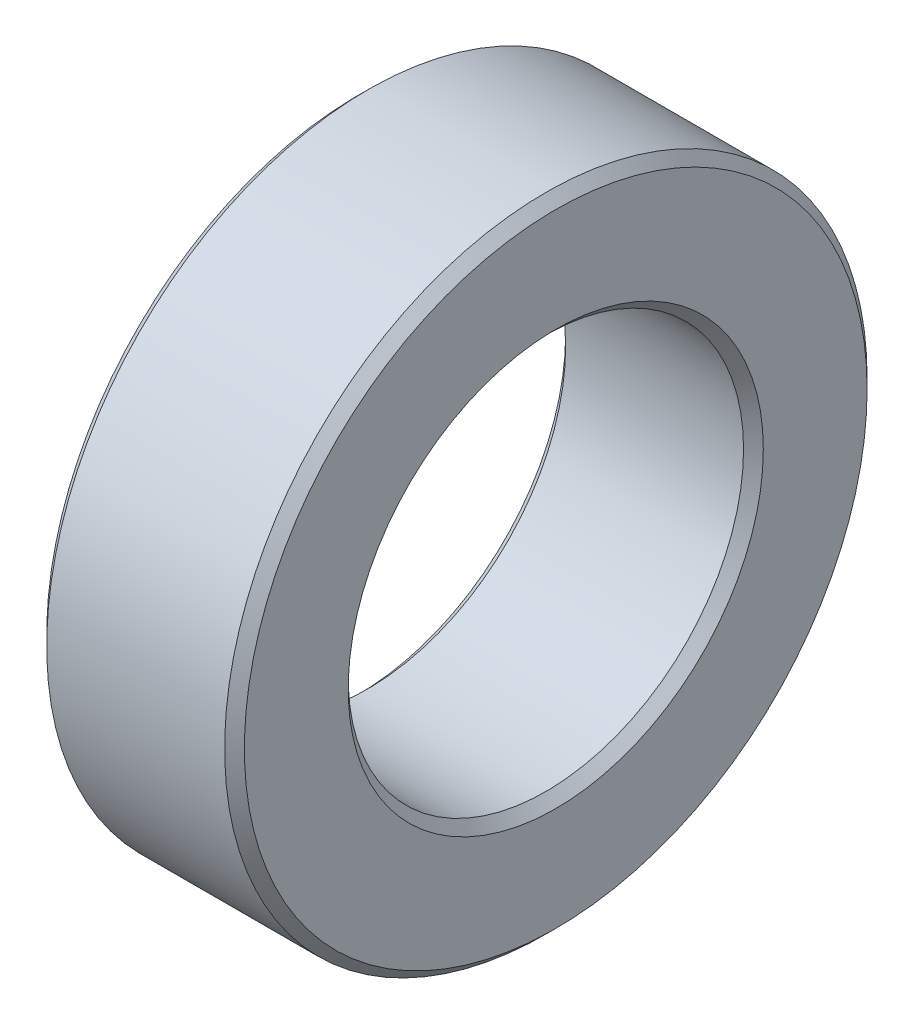
ISO-10303-21;
HEADER;
FILE_DESCRIPTION(('STEP AP214'),'2;1');
FILE_NAME('part.step','',(''),(''),'','','');
FILE_SCHEMA(('AUTOMOTIVE_DESIGN { 1 0 10303 214 1 1 1 1 }'));
ENDSEC;
DATA;
#1=APPLICATION_CONTEXT('core data for automotive mechanical design processes');
#2=APPLICATION_PROTOCOL_DEFINITION('international standard','automotive_design',2000,#1);
#3=PRODUCT_CONTEXT('',#1,'mechanical');
#4=PRODUCT('Part','Part','',(#3));
#5=PRODUCT_RELATED_PRODUCT_CATEGORY('part','',(#4));
#6=PRODUCT_DEFINITION_FORMATION('','',#4);
#7=PRODUCT_DEFINITION_CONTEXT('part definition',#1,'design');
#8=PRODUCT_DEFINITION('design','',#6,#7);
#9=PRODUCT_DEFINITION_SHAPE('','',#8);
#10=(LENGTH_UNIT() NAMED_UNIT(*) SI_UNIT(.MILLI.,.METRE.));
#11=(NAMED_UNIT(*) PLANE_ANGLE_UNIT() SI_UNIT($,.RADIAN.));
#12=(NAMED_UNIT(*) SI_UNIT($,.STERADIAN.) SOLID_ANGLE_UNIT());
#13=UNCERTAINTY_MEASURE_WITH_UNIT(LENGTH_MEASURE(1.E-05),#10,'distance_accuracy_value','');
#14=(GEOMETRIC_REPRESENTATION_CONTEXT(3) GLOBAL_UNCERTAINTY_ASSIGNED_CONTEXT((#13)) GLOBAL_UNIT_ASSIGNED_CONTEXT((#10,
#11,#12)) REPRESENTATION_CONTEXT('',''));
#15=CARTESIAN_POINT('',(0.,0.,0.));
#16=DIRECTION('',(0.,0.,1.));
#17=DIRECTION('',(1.,0.,0.));
#18=AXIS2_PLACEMENT_3D('',#15,#16,#17);
#19=CARTESIAN_POINT('',(4.,0.,0.));
#20=DIRECTION('',(1.,0.,0.));
#21=DIRECTION('',(0.,0.,-1.));
#22=AXIS2_PLACEMENT_3D('',#19,#20,#21);
#23=PLANE('',#22);
#24=CARTESIAN_POINT('',(4.,0.,0.));
#25=DIRECTION('',(1.,0.,0.));
#26=DIRECTION('',(0.,0.,-1.));
#27=AXIS2_PLACEMENT_3D('',#24,#25,#26);
#28=CIRCLE('',#27,4.2);
#29=CARTESIAN_POINT('',(4.,0.,-4.2));
#30=VERTEX_POINT('',#29);
#31=EDGE_CURVE('E10',#30,#30,#28,.F.);
#32=ORIENTED_EDGE('',*,*,#31,.T.);
#33=EDGE_LOOP('',(#32));
#34=FACE_BOUND('',#33,.T.);
#35=CARTESIAN_POINT('',(4.,0.,0.));
#36=DIRECTION('',(1.,0.,0.));
#37=DIRECTION('',(0.,0.,-1.));
#38=AXIS2_PLACEMENT_3D('',#35,#36,#37);
#39=CIRCLE('',#38,6.30000000000001);
#40=CARTESIAN_POINT('',(4.,0.,-6.30000000000001));
#41=VERTEX_POINT('',#40);
#42=EDGE_CURVE('E40',#41,#41,#39,.T.);
#43=ORIENTED_EDGE('',*,*,#42,.T.);
#44=EDGE_LOOP('',(#43));
#45=FACE_BOUND('',#44,.T.);
#46=ADVANCED_FACE('F33',(#34,#45),#23,.T.);
#47=CARTESIAN_POINT('',(0.,0.,0.));
#48=DIRECTION('',(1.,0.,0.));
#49=DIRECTION('',(0.,0.,-1.));
#50=AXIS2_PLACEMENT_3D('',#47,#48,#49);
#51=PLANE('',#50);
#52=CARTESIAN_POINT('',(0.,0.,0.));
#53=DIRECTION('',(1.,0.,0.));
#54=DIRECTION('',(0.,0.,-1.));
#55=AXIS2_PLACEMENT_3D('',#52,#53,#54);
#56=CIRCLE('',#55,4.2);
#57=CARTESIAN_POINT('',(0.,0.,-4.2));
#58=VERTEX_POINT('',#57);
#59=EDGE_CURVE('E59',#58,#58,#56,.T.);
#60=ORIENTED_EDGE('',*,*,#59,.T.);
#61=EDGE_LOOP('',(#60));
#62=FACE_BOUND('',#61,.T.);
#63=CARTESIAN_POINT('',(0.,0.,0.));
#64=DIRECTION('',(1.,0.,0.));
#65=DIRECTION('',(0.,0.,-1.));
#66=AXIS2_PLACEMENT_3D('',#63,#64,#65);
#67=CIRCLE('',#66,6.3);
#68=CARTESIAN_POINT('',(0.,0.,-6.3));
#69=VERTEX_POINT('',#68);
#70=EDGE_CURVE('E62',#69,#69,#67,.F.);
#71=ORIENTED_EDGE('',*,*,#70,.T.);
#72=EDGE_LOOP('',(#71));
#73=FACE_BOUND('',#72,.T.);
#74=ADVANCED_FACE('F66',(#62,#73),#51,.F.);
#75=CARTESIAN_POINT('',(4.,0.,0.));
#76=DIRECTION('',(-1.,0.,0.));
#77=DIRECTION('',(0.,0.,1.));
#78=AXIS2_PLACEMENT_3D('',#75,#76,#77);
#79=CYLINDRICAL_SURFACE('',#78,6.5);
#80=CARTESIAN_POINT('',(0.2,0.,0.));
#81=DIRECTION('',(1.,0.,0.));
#82=DIRECTION('',(0.,0.,-1.));
#83=AXIS2_PLACEMENT_3D('',#80,#81,#82);
#84=CIRCLE('',#83,6.5);
#85=CARTESIAN_POINT('',(0.2,0.,-6.5));
#86=VERTEX_POINT('',#85);
#87=EDGE_CURVE('E44',#86,#86,#84,.T.);
#88=ORIENTED_EDGE('',*,*,#87,.T.);
#89=EDGE_LOOP('',(#88));
#90=FACE_BOUND('',#89,.T.);
#91=CARTESIAN_POINT('',(3.8,0.,0.));
#92=DIRECTION('',(1.,0.,0.));
#93=DIRECTION('',(0.,0.,-1.));
#94=AXIS2_PLACEMENT_3D('',#91,#92,#93);
#95=CIRCLE('',#94,6.5);
#96=CARTESIAN_POINT('',(3.8,0.,-6.5));
#97=VERTEX_POINT('',#96);
#98=EDGE_CURVE('E48',#97,#97,#95,.F.);
#99=ORIENTED_EDGE('',*,*,#98,.T.);
#100=EDGE_LOOP('',(#99));
#101=FACE_BOUND('',#100,.T.);
#102=ADVANCED_FACE('F76',(#90,#101),#79,.T.);
#103=CARTESIAN_POINT('',(4.,0.,0.));
#104=DIRECTION('',(-1.,0.,0.));
#105=DIRECTION('',(0.,0.,1.));
#106=AXIS2_PLACEMENT_3D('',#103,#104,#105);
#107=CYLINDRICAL_SURFACE('',#106,4.);
#108=CARTESIAN_POINT('',(0.200000000000001,0.,0.));
#109=DIRECTION('',(1.,0.,0.));
#110=DIRECTION('',(0.,0.,-1.));
#111=AXIS2_PLACEMENT_3D('',#108,#109,#110);
#112=CIRCLE('',#111,4.);
#113=CARTESIAN_POINT('',(0.200000000000001,0.,-4.));
#114=VERTEX_POINT('',#113);
#115=EDGE_CURVE('E53',#114,#114,#112,.F.);
#116=ORIENTED_EDGE('',*,*,#115,.T.);
#117=EDGE_LOOP('',(#116));
#118=FACE_BOUND('',#117,.T.);
#119=CARTESIAN_POINT('',(3.80000000000001,0.,0.));
#120=DIRECTION('',(1.,0.,0.));
#121=DIRECTION('',(0.,0.,-1.));
#122=AXIS2_PLACEMENT_3D('',#119,#120,#121);
#123=CIRCLE('',#122,4.);
#124=CARTESIAN_POINT('',(3.80000000000001,0.,-4.));
#125=VERTEX_POINT('',#124);
#126=EDGE_CURVE('E56',#125,#125,#123,.T.);
#127=ORIENTED_EDGE('',*,*,#126,.T.);
#128=EDGE_LOOP('',(#127));
#129=FACE_BOUND('',#128,.T.);
#130=ADVANCED_FACE('F79',(#118,#129),#107,.F.);
#131=CARTESIAN_POINT('',(0.,0.,0.));
#132=DIRECTION('',(-1.,0.,0.));
#133=DIRECTION('',(0.,0.,1.));
#134=AXIS2_PLACEMENT_3D('',#131,#132,#133);
#135=CONICAL_SURFACE('',#134,4.2,0.785398163397444);
#136=ORIENTED_EDGE('',*,*,#115,.F.);
#137=EDGE_LOOP('',(#136));
#138=FACE_BOUND('',#137,.T.);
#139=ORIENTED_EDGE('',*,*,#59,.F.);
#140=EDGE_LOOP('',(#139));
#141=FACE_BOUND('',#140,.T.);
#142=ADVANCED_FACE('F72',(#138,#141),#135,.F.);
#143=CARTESIAN_POINT('',(0.2,0.,0.));
#144=DIRECTION('',(1.,0.,0.));
#145=DIRECTION('',(0.,0.,-1.));
#146=AXIS2_PLACEMENT_3D('',#143,#144,#145);
#147=CONICAL_SURFACE('',#146,6.5,0.78539816339745);
#148=ORIENTED_EDGE('',*,*,#70,.F.);
#149=EDGE_LOOP('',(#148));
#150=FACE_BOUND('',#149,.T.);
#151=ORIENTED_EDGE('',*,*,#87,.F.);
#152=EDGE_LOOP('',(#151));
#153=FACE_BOUND('',#152,.T.);
#154=ADVANCED_FACE('F68',(#150,#153),#147,.T.);
#155=CARTESIAN_POINT('',(3.80000000000001,0.,0.));
#156=DIRECTION('',(1.,0.,0.));
#157=DIRECTION('',(0.,0.,-1.));
#158=AXIS2_PLACEMENT_3D('',#155,#156,#157);
#159=CONICAL_SURFACE('',#158,4.,0.785398163397455);
#160=ORIENTED_EDGE('',*,*,#31,.F.);
#161=EDGE_LOOP('',(#160));
#162=FACE_BOUND('',#161,.T.);
#163=ORIENTED_EDGE('',*,*,#126,.F.);
#164=EDGE_LOOP('',(#163));
#165=FACE_BOUND('',#164,.T.);
#166=ADVANCED_FACE('F71',(#162,#165),#159,.F.);
#167=CARTESIAN_POINT('',(4.,0.,0.));
#168=DIRECTION('',(-1.,0.,0.));
#169=DIRECTION('',(0.,0.,1.));
#170=AXIS2_PLACEMENT_3D('',#167,#168,#169);
#171=CONICAL_SURFACE('',#170,6.30000000000001,0.78539816339744);
#172=ORIENTED_EDGE('',*,*,#98,.F.);
#173=EDGE_LOOP('',(#172));
#174=FACE_BOUND('',#173,.T.);
#175=ORIENTED_EDGE('',*,*,#42,.F.);
#176=EDGE_LOOP('',(#175));
#177=FACE_BOUND('',#176,.T.);
#178=ADVANCED_FACE('F35',(#174,#177),#171,.T.);
#179=CLOSED_SHELL('',(#46,#74,#102,#130,#142,#154,#166,#178));
#180=MANIFOLD_SOLID_BREP('B2',#179);
#181=ADVANCED_BREP_SHAPE_REPRESENTATION('',(#18,#180),#14);
#182=SHAPE_DEFINITION_REPRESENTATION(#9,#181);
ENDSEC;
END-ISO-10303-21;
